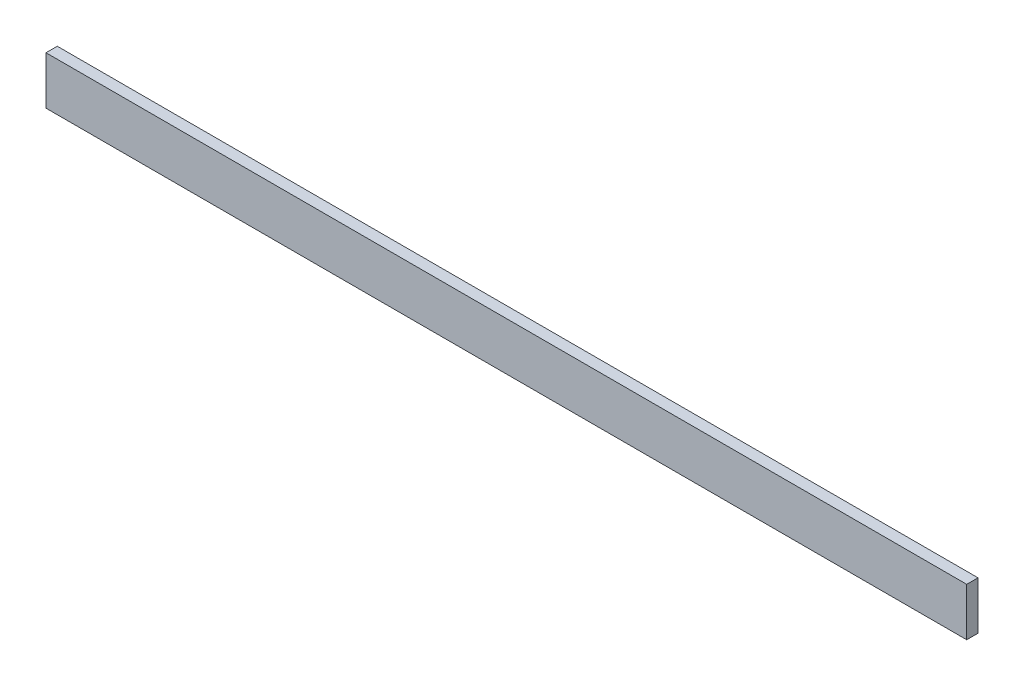
ISO-10303-21;
HEADER;
FILE_DESCRIPTION(('STEP AP214'),'2;1');
FILE_NAME('part.step','',(''),(''),'','','');
FILE_SCHEMA(('AUTOMOTIVE_DESIGN { 1 0 10303 214 1 1 1 1 }'));
ENDSEC;
DATA;
#1=APPLICATION_CONTEXT('core data for automotive mechanical design processes');
#2=APPLICATION_PROTOCOL_DEFINITION('international standard','automotive_design',2000,#1);
#3=PRODUCT_CONTEXT('',#1,'mechanical');
#4=PRODUCT('Part','Part','',(#3));
#5=PRODUCT_RELATED_PRODUCT_CATEGORY('part','',(#4));
#6=PRODUCT_DEFINITION_FORMATION('','',#4);
#7=PRODUCT_DEFINITION_CONTEXT('part definition',#1,'design');
#8=PRODUCT_DEFINITION('design','',#6,#7);
#9=PRODUCT_DEFINITION_SHAPE('','',#8);
#10=(LENGTH_UNIT() NAMED_UNIT(*) SI_UNIT(.MILLI.,.METRE.));
#11=(NAMED_UNIT(*) PLANE_ANGLE_UNIT() SI_UNIT($,.RADIAN.));
#12=(NAMED_UNIT(*) SI_UNIT($,.STERADIAN.) SOLID_ANGLE_UNIT());
#13=UNCERTAINTY_MEASURE_WITH_UNIT(LENGTH_MEASURE(1.E-05),#10,'distance_accuracy_value','');
#14=(GEOMETRIC_REPRESENTATION_CONTEXT(3) GLOBAL_UNCERTAINTY_ASSIGNED_CONTEXT((#13)) GLOBAL_UNIT_ASSIGNED_CONTEXT((#10,
#11,#12)) REPRESENTATION_CONTEXT('',''));
#15=CARTESIAN_POINT('',(0.,0.,0.));
#16=DIRECTION('',(0.,0.,1.));
#17=DIRECTION('',(1.,0.,0.));
#18=AXIS2_PLACEMENT_3D('',#15,#16,#17);
#19=CARTESIAN_POINT('',(0.,0.,11.938));
#20=DIRECTION('',(0.,1.,0.));
#21=DIRECTION('',(0.,0.,1.));
#22=AXIS2_PLACEMENT_3D('',#19,#20,#21);
#23=PLANE('',#22);
#24=DIRECTION('',(1.,0.,0.));
#25=VECTOR('',#24,1.);
#26=CARTESIAN_POINT('',(0.,0.,0.));
#27=LINE('',#26,#25);
#28=CARTESIAN_POINT('',(0.,0.,0.));
#29=VERTEX_POINT('',#28);
#30=CARTESIAN_POINT('',(973.836,0.,0.));
#31=VERTEX_POINT('',#30);
#32=EDGE_CURVE('E96',#29,#31,#27,.T.);
#33=ORIENTED_EDGE('',*,*,#32,.T.);
#34=DIRECTION('',(0.,0.,-1.));
#35=VECTOR('',#34,1.);
#36=CARTESIAN_POINT('',(973.836,0.,11.938));
#37=LINE('',#36,#35);
#38=CARTESIAN_POINT('',(973.836,0.,11.938));
#39=VERTEX_POINT('',#38);
#40=EDGE_CURVE('E11',#39,#31,#37,.T.);
#41=ORIENTED_EDGE('',*,*,#40,.F.);
#42=DIRECTION('',(1.,0.,0.));
#43=VECTOR('',#42,1.);
#44=CARTESIAN_POINT('',(0.,0.,11.938));
#45=LINE('',#44,#43);
#46=CARTESIAN_POINT('',(0.,0.,11.938));
#47=VERTEX_POINT('',#46);
#48=EDGE_CURVE('E84',#47,#39,#45,.T.);
#49=ORIENTED_EDGE('',*,*,#48,.F.);
#50=DIRECTION('',(0.,0.,-1.));
#51=VECTOR('',#50,1.);
#52=CARTESIAN_POINT('',(0.,0.,11.938));
#53=LINE('',#52,#51);
#54=EDGE_CURVE('E92',#47,#29,#53,.T.);
#55=ORIENTED_EDGE('',*,*,#54,.T.);
#56=EDGE_LOOP('',(#33,#41,#49,#55));
#57=FACE_BOUND('',#56,.T.);
#58=ADVANCED_FACE('F33',(#57),#23,.F.);
#59=CARTESIAN_POINT('',(973.836,50.8,11.938));
#60=DIRECTION('',(-1.,0.,0.));
#61=DIRECTION('',(0.,0.,1.));
#62=AXIS2_PLACEMENT_3D('',#59,#60,#61);
#63=PLANE('',#62);
#64=DIRECTION('',(0.,1.,0.));
#65=VECTOR('',#64,1.);
#66=CARTESIAN_POINT('',(973.836,50.8,0.));
#67=LINE('',#66,#65);
#68=CARTESIAN_POINT('',(973.836,50.8,0.));
#69=VERTEX_POINT('',#68);
#70=EDGE_CURVE('E88',#31,#69,#67,.T.);
#71=ORIENTED_EDGE('',*,*,#70,.T.);
#72=DIRECTION('',(0.,0.,-1.));
#73=VECTOR('',#72,1.);
#74=CARTESIAN_POINT('',(973.836,50.8,11.938));
#75=LINE('',#74,#73);
#76=CARTESIAN_POINT('',(973.836,50.8,11.938));
#77=VERTEX_POINT('',#76);
#78=EDGE_CURVE('E41',#77,#69,#75,.T.);
#79=ORIENTED_EDGE('',*,*,#78,.F.);
#80=DIRECTION('',(0.,1.,0.));
#81=VECTOR('',#80,1.);
#82=CARTESIAN_POINT('',(973.836,50.8,11.938));
#83=LINE('',#82,#81);
#84=EDGE_CURVE('E79',#39,#77,#83,.T.);
#85=ORIENTED_EDGE('',*,*,#84,.F.);
#86=ORIENTED_EDGE('',*,*,#40,.T.);
#87=EDGE_LOOP('',(#71,#79,#85,#86));
#88=FACE_BOUND('',#87,.T.);
#89=ADVANCED_FACE('F87',(#88),#63,.F.);
#90=CARTESIAN_POINT('',(0.,50.8,11.938));
#91=DIRECTION('',(0.,-1.,0.));
#92=DIRECTION('',(0.,0.,-1.));
#93=AXIS2_PLACEMENT_3D('',#90,#91,#92);
#94=PLANE('',#93);
#95=DIRECTION('',(-1.,0.,0.));
#96=VECTOR('',#95,1.);
#97=CARTESIAN_POINT('',(0.,50.8,0.));
#98=LINE('',#97,#96);
#99=CARTESIAN_POINT('',(0.,50.8,0.));
#100=VERTEX_POINT('',#99);
#101=EDGE_CURVE('E66',#69,#100,#98,.T.);
#102=ORIENTED_EDGE('',*,*,#101,.T.);
#103=DIRECTION('',(0.,0.,-1.));
#104=VECTOR('',#103,1.);
#105=CARTESIAN_POINT('',(0.,50.8,11.938));
#106=LINE('',#105,#104);
#107=CARTESIAN_POINT('',(0.,50.8,11.938));
#108=VERTEX_POINT('',#107);
#109=EDGE_CURVE('E89',#108,#100,#106,.T.);
#110=ORIENTED_EDGE('',*,*,#109,.F.);
#111=DIRECTION('',(-1.,0.,0.));
#112=VECTOR('',#111,1.);
#113=CARTESIAN_POINT('',(0.,50.8,11.938));
#114=LINE('',#113,#112);
#115=EDGE_CURVE('E82',#77,#108,#114,.T.);
#116=ORIENTED_EDGE('',*,*,#115,.F.);
#117=ORIENTED_EDGE('',*,*,#78,.T.);
#118=EDGE_LOOP('',(#102,#110,#116,#117));
#119=FACE_BOUND('',#118,.T.);
#120=ADVANCED_FACE('F90',(#119),#94,.F.);
#121=CARTESIAN_POINT('',(0.,0.,11.938));
#122=DIRECTION('',(1.,0.,0.));
#123=DIRECTION('',(0.,0.,-1.));
#124=AXIS2_PLACEMENT_3D('',#121,#122,#123);
#125=PLANE('',#124);
#126=DIRECTION('',(0.,-1.,0.));
#127=VECTOR('',#126,1.);
#128=CARTESIAN_POINT('',(0.,0.,0.));
#129=LINE('',#128,#127);
#130=EDGE_CURVE('E72',#100,#29,#129,.T.);
#131=ORIENTED_EDGE('',*,*,#130,.T.);
#132=ORIENTED_EDGE('',*,*,#54,.F.);
#133=DIRECTION('',(0.,-1.,0.));
#134=VECTOR('',#133,1.);
#135=CARTESIAN_POINT('',(0.,0.,11.938));
#136=LINE('',#135,#134);
#137=EDGE_CURVE('E49',#108,#47,#136,.T.);
#138=ORIENTED_EDGE('',*,*,#137,.F.);
#139=ORIENTED_EDGE('',*,*,#109,.T.);
#140=EDGE_LOOP('',(#131,#132,#138,#139));
#141=FACE_BOUND('',#140,.T.);
#142=ADVANCED_FACE('F103',(#141),#125,.F.);
#143=CARTESIAN_POINT('',(0.,0.,11.938));
#144=DIRECTION('',(0.,0.,-1.));
#145=DIRECTION('',(-1.,0.,0.));
#146=AXIS2_PLACEMENT_3D('',#143,#144,#145);
#147=PLANE('',#146);
#148=ORIENTED_EDGE('',*,*,#48,.T.);
#149=ORIENTED_EDGE('',*,*,#84,.T.);
#150=ORIENTED_EDGE('',*,*,#115,.T.);
#151=ORIENTED_EDGE('',*,*,#137,.T.);
#152=EDGE_LOOP('',(#148,#149,#150,#151));
#153=FACE_BOUND('',#152,.T.);
#154=ADVANCED_FACE('F80',(#153),#147,.F.);
#155=CARTESIAN_POINT('',(0.,0.,0.));
#156=DIRECTION('',(0.,0.,-1.));
#157=DIRECTION('',(-1.,0.,0.));
#158=AXIS2_PLACEMENT_3D('',#155,#156,#157);
#159=PLANE('',#158);
#160=ORIENTED_EDGE('',*,*,#32,.F.);
#161=ORIENTED_EDGE('',*,*,#130,.F.);
#162=ORIENTED_EDGE('',*,*,#101,.F.);
#163=ORIENTED_EDGE('',*,*,#70,.F.);
#164=EDGE_LOOP('',(#160,#161,#162,#163));
#165=FACE_BOUND('',#164,.T.);
#166=ADVANCED_FACE('F106',(#165),#159,.T.);
#167=CLOSED_SHELL('',(#58,#89,#120,#142,#154,#166));
#168=MANIFOLD_SOLID_BREP('B2',#167);
#169=ADVANCED_BREP_SHAPE_REPRESENTATION('',(#18,#168),#14);
#170=SHAPE_DEFINITION_REPRESENTATION(#9,#169);
ENDSEC;
END-ISO-10303-21;
